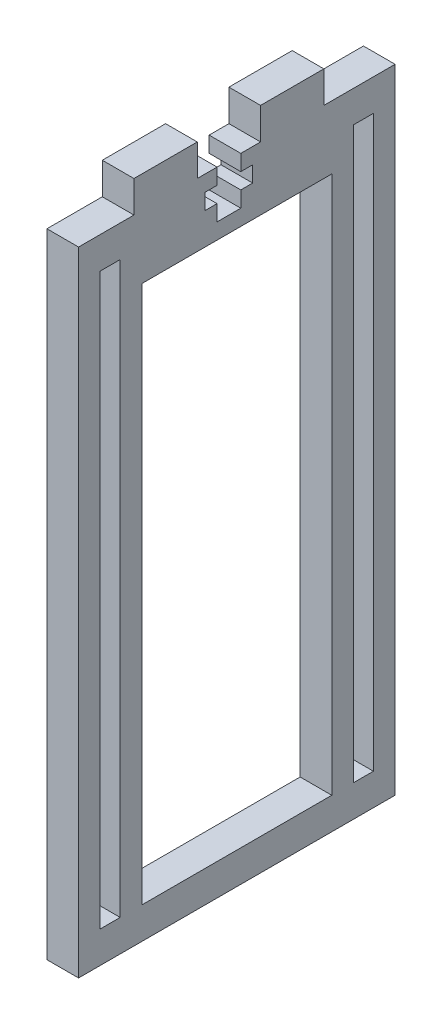
ISO-10303-21;
HEADER;
FILE_DESCRIPTION(('STEP AP214'),'2;1');
FILE_NAME('part.step','',(''),(''),'','','');
FILE_SCHEMA(('AUTOMOTIVE_DESIGN { 1 0 10303 214 1 1 1 1 }'));
ENDSEC;
DATA;
#1=APPLICATION_CONTEXT('core data for automotive mechanical design processes');
#2=APPLICATION_PROTOCOL_DEFINITION('international standard','automotive_design',2000,#1);
#3=PRODUCT_CONTEXT('',#1,'mechanical');
#4=PRODUCT('Part','Part','',(#3));
#5=PRODUCT_RELATED_PRODUCT_CATEGORY('part','',(#4));
#6=PRODUCT_DEFINITION_FORMATION('','',#4);
#7=PRODUCT_DEFINITION_CONTEXT('part definition',#1,'design');
#8=PRODUCT_DEFINITION('design','',#6,#7);
#9=PRODUCT_DEFINITION_SHAPE('','',#8);
#10=(LENGTH_UNIT() NAMED_UNIT(*) SI_UNIT(.MILLI.,.METRE.));
#11=(NAMED_UNIT(*) PLANE_ANGLE_UNIT() SI_UNIT($,.RADIAN.));
#12=(NAMED_UNIT(*) SI_UNIT($,.STERADIAN.) SOLID_ANGLE_UNIT());
#13=UNCERTAINTY_MEASURE_WITH_UNIT(LENGTH_MEASURE(1.E-05),#10,'distance_accuracy_value','');
#14=(GEOMETRIC_REPRESENTATION_CONTEXT(3) GLOBAL_UNCERTAINTY_ASSIGNED_CONTEXT((#13)) GLOBAL_UNIT_ASSIGNED_CONTEXT((#10,
#11,#12)) REPRESENTATION_CONTEXT('',''));
#15=CARTESIAN_POINT('',(0.,0.,0.));
#16=DIRECTION('',(0.,0.,1.));
#17=DIRECTION('',(1.,0.,0.));
#18=AXIS2_PLACEMENT_3D('',#15,#16,#17);
#19=CARTESIAN_POINT('',(6.35,127.,0.));
#20=DIRECTION('',(0.,1.,0.));
#21=DIRECTION('',(0.,0.,1.));
#22=AXIS2_PLACEMENT_3D('',#19,#20,#21);
#23=PLANE('',#22);
#24=DIRECTION('',(0.,0.,-1.));
#25=VECTOR('',#24,1.);
#26=CARTESIAN_POINT('',(6.35,127.,0.));
#27=LINE('',#26,#25);
#28=CARTESIAN_POINT('',(6.35,127.,-23.8125));
#29=VERTEX_POINT('',#28);
#30=CARTESIAN_POINT('',(6.35,127.,-27.78125));
#31=VERTEX_POINT('',#30);
#32=EDGE_CURVE('E435',#29,#31,#27,.T.);
#33=ORIENTED_EDGE('',*,*,#32,.T.);
#34=DIRECTION('',(-1.,0.,0.));
#35=VECTOR('',#34,1.);
#36=CARTESIAN_POINT('',(6.35,127.,-27.78125));
#37=LINE('',#36,#35);
#38=CARTESIAN_POINT('',(0.,127.,-27.78125));
#39=VERTEX_POINT('',#38);
#40=EDGE_CURVE('E341',#31,#39,#37,.T.);
#41=ORIENTED_EDGE('',*,*,#40,.T.);
#42=DIRECTION('',(0.,0.,-1.));
#43=VECTOR('',#42,1.);
#44=CARTESIAN_POINT('',(0.,127.,0.));
#45=LINE('',#44,#43);
#46=CARTESIAN_POINT('',(0.,127.,-23.8125));
#47=VERTEX_POINT('',#46);
#48=EDGE_CURVE('E499',#47,#39,#45,.T.);
#49=ORIENTED_EDGE('',*,*,#48,.F.);
#50=DIRECTION('',(-1.,0.,0.));
#51=VECTOR('',#50,1.);
#52=CARTESIAN_POINT('',(6.35,127.,-23.8125));
#53=LINE('',#52,#51);
#54=EDGE_CURVE('E534',#29,#47,#53,.T.);
#55=ORIENTED_EDGE('',*,*,#54,.F.);
#56=EDGE_LOOP('',(#33,#41,#49,#55));
#57=FACE_BOUND('',#56,.T.);
#58=ADVANCED_FACE('F59',(#57),#23,.T.);
#59=CARTESIAN_POINT('',(6.35,0.,-63.5));
#60=DIRECTION('',(0.,0.,1.));
#61=DIRECTION('',(1.,0.,0.));
#62=AXIS2_PLACEMENT_3D('',#59,#60,#61);
#63=PLANE('',#62);
#64=DIRECTION('',(0.,1.,0.));
#65=VECTOR('',#64,1.);
#66=CARTESIAN_POINT('',(0.,0.,-63.5));
#67=LINE('',#66,#65);
#68=CARTESIAN_POINT('',(0.,0.,-63.5));
#69=VERTEX_POINT('',#68);
#70=CARTESIAN_POINT('',(0.,127.,-63.5));
#71=VERTEX_POINT('',#70);
#72=EDGE_CURVE('E481',#69,#71,#67,.T.);
#73=ORIENTED_EDGE('',*,*,#72,.T.);
#74=DIRECTION('',(-1.,0.,0.));
#75=VECTOR('',#74,1.);
#76=CARTESIAN_POINT('',(6.35,127.,-63.5));
#77=LINE('',#76,#75);
#78=CARTESIAN_POINT('',(6.35,127.,-63.5));
#79=VERTEX_POINT('',#78);
#80=EDGE_CURVE('E68',#79,#71,#77,.T.);
#81=ORIENTED_EDGE('',*,*,#80,.F.);
#82=DIRECTION('',(0.,1.,0.));
#83=VECTOR('',#82,1.);
#84=CARTESIAN_POINT('',(6.35,0.,-63.5));
#85=LINE('',#84,#83);
#86=CARTESIAN_POINT('',(6.35,0.,-63.5));
#87=VERTEX_POINT('',#86);
#88=EDGE_CURVE('E421',#87,#79,#85,.T.);
#89=ORIENTED_EDGE('',*,*,#88,.F.);
#90=DIRECTION('',(-1.,0.,0.));
#91=VECTOR('',#90,1.);
#92=CARTESIAN_POINT('',(6.35,0.,-63.5));
#93=LINE('',#92,#91);
#94=EDGE_CURVE('E12',#87,#69,#93,.T.);
#95=ORIENTED_EDGE('',*,*,#94,.T.);
#96=EDGE_LOOP('',(#73,#81,#89,#95));
#97=FACE_BOUND('',#96,.T.);
#98=ADVANCED_FACE('F586',(#97),#63,.F.);
#99=CARTESIAN_POINT('',(6.35,127.,0.));
#100=DIRECTION('',(0.,1.,0.));
#101=DIRECTION('',(0.,0.,1.));
#102=AXIS2_PLACEMENT_3D('',#99,#100,#101);
#103=PLANE('',#102);
#104=DIRECTION('',(0.,0.,-1.));
#105=VECTOR('',#104,1.);
#106=CARTESIAN_POINT('',(0.,127.,0.));
#107=LINE('',#106,#105);
#108=CARTESIAN_POINT('',(0.,127.,-49.2125));
#109=VERTEX_POINT('',#108);
#110=EDGE_CURVE('E486',#109,#71,#107,.T.);
#111=ORIENTED_EDGE('',*,*,#110,.F.);
#112=DIRECTION('',(-1.,0.,0.));
#113=VECTOR('',#112,1.);
#114=CARTESIAN_POINT('',(6.35,127.,-49.2125));
#115=LINE('',#114,#113);
#116=CARTESIAN_POINT('',(6.35,127.,-49.2125));
#117=VERTEX_POINT('',#116);
#118=EDGE_CURVE('E543',#117,#109,#115,.T.);
#119=ORIENTED_EDGE('',*,*,#118,.F.);
#120=DIRECTION('',(0.,0.,-1.));
#121=VECTOR('',#120,1.);
#122=CARTESIAN_POINT('',(6.35,127.,0.));
#123=LINE('',#122,#121);
#124=EDGE_CURVE('E423',#117,#79,#123,.T.);
#125=ORIENTED_EDGE('',*,*,#124,.T.);
#126=ORIENTED_EDGE('',*,*,#80,.T.);
#127=EDGE_LOOP('',(#111,#119,#125,#126));
#128=FACE_BOUND('',#127,.T.);
#129=ADVANCED_FACE('F593',(#128),#103,.T.);
#130=CARTESIAN_POINT('',(6.35,0.,-49.2125));
#131=DIRECTION('',(0.,0.,1.));
#132=DIRECTION('',(1.,0.,0.));
#133=AXIS2_PLACEMENT_3D('',#130,#131,#132);
#134=PLANE('',#133);
#135=DIRECTION('',(0.,1.,0.));
#136=VECTOR('',#135,1.);
#137=CARTESIAN_POINT('',(0.,0.,-49.2125));
#138=LINE('',#137,#136);
#139=CARTESIAN_POINT('',(0.,133.35,-49.2125));
#140=VERTEX_POINT('',#139);
#141=EDGE_CURVE('E489',#109,#140,#138,.T.);
#142=ORIENTED_EDGE('',*,*,#141,.T.);
#143=DIRECTION('',(-1.,0.,0.));
#144=VECTOR('',#143,1.);
#145=CARTESIAN_POINT('',(6.35,133.35,-49.2125));
#146=LINE('',#145,#144);
#147=CARTESIAN_POINT('',(6.35,133.35,-49.2125));
#148=VERTEX_POINT('',#147);
#149=EDGE_CURVE('E541',#148,#140,#146,.T.);
#150=ORIENTED_EDGE('',*,*,#149,.F.);
#151=DIRECTION('',(0.,1.,0.));
#152=VECTOR('',#151,1.);
#153=CARTESIAN_POINT('',(6.35,0.,-49.2125));
#154=LINE('',#153,#152);
#155=EDGE_CURVE('E426',#117,#148,#154,.T.);
#156=ORIENTED_EDGE('',*,*,#155,.F.);
#157=ORIENTED_EDGE('',*,*,#118,.T.);
#158=EDGE_LOOP('',(#142,#150,#156,#157));
#159=FACE_BOUND('',#158,.T.);
#160=ADVANCED_FACE('F704',(#159),#134,.F.);
#161=CARTESIAN_POINT('',(6.35,133.35,0.));
#162=DIRECTION('',(0.,1.,0.));
#163=DIRECTION('',(0.,0.,1.));
#164=AXIS2_PLACEMENT_3D('',#161,#162,#163);
#165=PLANE('',#164);
#166=DIRECTION('',(0.,0.,-1.));
#167=VECTOR('',#166,1.);
#168=CARTESIAN_POINT('',(0.,133.35,0.));
#169=LINE('',#168,#167);
#170=CARTESIAN_POINT('',(0.,133.35,-36.5125));
#171=VERTEX_POINT('',#170);
#172=EDGE_CURVE('E492',#171,#140,#169,.T.);
#173=ORIENTED_EDGE('',*,*,#172,.F.);
#174=DIRECTION('',(-1.,0.,0.));
#175=VECTOR('',#174,1.);
#176=CARTESIAN_POINT('',(6.35,133.35,-36.5125));
#177=LINE('',#176,#175);
#178=CARTESIAN_POINT('',(6.35,133.35,-36.5125));
#179=VERTEX_POINT('',#178);
#180=EDGE_CURVE('E539',#179,#171,#177,.T.);
#181=ORIENTED_EDGE('',*,*,#180,.F.);
#182=DIRECTION('',(0.,0.,-1.));
#183=VECTOR('',#182,1.);
#184=CARTESIAN_POINT('',(6.35,133.35,0.));
#185=LINE('',#184,#183);
#186=EDGE_CURVE('E428',#179,#148,#185,.T.);
#187=ORIENTED_EDGE('',*,*,#186,.T.);
#188=ORIENTED_EDGE('',*,*,#149,.T.);
#189=EDGE_LOOP('',(#173,#181,#187,#188));
#190=FACE_BOUND('',#189,.T.);
#191=ADVANCED_FACE('F608',(#190),#165,.T.);
#192=CARTESIAN_POINT('',(6.35,0.,-36.5125));
#193=DIRECTION('',(0.,0.,1.));
#194=DIRECTION('',(1.,0.,0.));
#195=AXIS2_PLACEMENT_3D('',#192,#193,#194);
#196=PLANE('',#195);
#197=DIRECTION('',(0.,1.,0.));
#198=VECTOR('',#197,1.);
#199=CARTESIAN_POINT('',(0.,0.,-36.5125));
#200=LINE('',#199,#198);
#201=CARTESIAN_POINT('',(0.,127.,-36.5125));
#202=VERTEX_POINT('',#201);
#203=EDGE_CURVE('E495',#202,#171,#200,.T.);
#204=ORIENTED_EDGE('',*,*,#203,.F.);
#205=DIRECTION('',(-1.,0.,0.));
#206=VECTOR('',#205,1.);
#207=CARTESIAN_POINT('',(6.35,127.,-36.5125));
#208=LINE('',#207,#206);
#209=CARTESIAN_POINT('',(6.35,127.,-36.5125));
#210=VERTEX_POINT('',#209);
#211=EDGE_CURVE('E536',#210,#202,#208,.T.);
#212=ORIENTED_EDGE('',*,*,#211,.F.);
#213=DIRECTION('',(0.,1.,0.));
#214=VECTOR('',#213,1.);
#215=CARTESIAN_POINT('',(6.35,0.,-36.5125));
#216=LINE('',#215,#214);
#217=EDGE_CURVE('E431',#210,#179,#216,.T.);
#218=ORIENTED_EDGE('',*,*,#217,.T.);
#219=ORIENTED_EDGE('',*,*,#180,.T.);
#220=EDGE_LOOP('',(#204,#212,#218,#219));
#221=FACE_BOUND('',#220,.T.);
#222=ADVANCED_FACE('F600',(#221),#196,.T.);
#223=DIRECTION('',(-1.,0.,0.));
#224=VECTOR('',#223,1.);
#225=CARTESIAN_POINT('',(6.35,127.,-32.54375));
#226=LINE('',#225,#224);
#227=CARTESIAN_POINT('',(6.35,127.,-32.54375));
#228=VERTEX_POINT('',#227);
#229=CARTESIAN_POINT('',(0.,127.,-32.54375));
#230=VERTEX_POINT('',#229);
#231=EDGE_CURVE('E329',#228,#230,#226,.T.);
#232=ORIENTED_EDGE('',*,*,#231,.F.);
#233=EDGE_CURVE('E434',#228,#210,#27,.T.);
#234=ORIENTED_EDGE('',*,*,#233,.T.);
#235=ORIENTED_EDGE('',*,*,#211,.T.);
#236=EDGE_CURVE('E498',#230,#202,#45,.T.);
#237=ORIENTED_EDGE('',*,*,#236,.F.);
#238=EDGE_LOOP('',(#232,#234,#235,#237));
#239=FACE_BOUND('',#238,.T.);
#240=ADVANCED_FACE('F589',(#239),#23,.T.);
#241=CARTESIAN_POINT('',(6.35,0.,-23.8125));
#242=DIRECTION('',(0.,0.,1.));
#243=DIRECTION('',(1.,0.,0.));
#244=AXIS2_PLACEMENT_3D('',#241,#242,#243);
#245=PLANE('',#244);
#246=DIRECTION('',(0.,1.,0.));
#247=VECTOR('',#246,1.);
#248=CARTESIAN_POINT('',(0.,0.,-23.8125));
#249=LINE('',#248,#247);
#250=CARTESIAN_POINT('',(0.,133.35,-23.8125));
#251=VERTEX_POINT('',#250);
#252=EDGE_CURVE('E502',#47,#251,#249,.T.);
#253=ORIENTED_EDGE('',*,*,#252,.T.);
#254=DIRECTION('',(-1.,0.,0.));
#255=VECTOR('',#254,1.);
#256=CARTESIAN_POINT('',(6.35,133.35,-23.8125));
#257=LINE('',#256,#255);
#258=CARTESIAN_POINT('',(6.35,133.35,-23.8125));
#259=VERTEX_POINT('',#258);
#260=EDGE_CURVE('E532',#259,#251,#257,.T.);
#261=ORIENTED_EDGE('',*,*,#260,.F.);
#262=DIRECTION('',(0.,1.,0.));
#263=VECTOR('',#262,1.);
#264=CARTESIAN_POINT('',(6.35,0.,-23.8125));
#265=LINE('',#264,#263);
#266=EDGE_CURVE('E438',#29,#259,#265,.T.);
#267=ORIENTED_EDGE('',*,*,#266,.F.);
#268=ORIENTED_EDGE('',*,*,#54,.T.);
#269=EDGE_LOOP('',(#253,#261,#267,#268));
#270=FACE_BOUND('',#269,.T.);
#271=ADVANCED_FACE('F599',(#270),#245,.F.);
#272=CARTESIAN_POINT('',(6.35,133.35,0.));
#273=DIRECTION('',(0.,1.,0.));
#274=DIRECTION('',(0.,0.,1.));
#275=AXIS2_PLACEMENT_3D('',#272,#273,#274);
#276=PLANE('',#275);
#277=DIRECTION('',(0.,0.,-1.));
#278=VECTOR('',#277,1.);
#279=CARTESIAN_POINT('',(0.,133.35,0.));
#280=LINE('',#279,#278);
#281=CARTESIAN_POINT('',(0.,133.35,-11.1125));
#282=VERTEX_POINT('',#281);
#283=EDGE_CURVE('E505',#282,#251,#280,.T.);
#284=ORIENTED_EDGE('',*,*,#283,.F.);
#285=DIRECTION('',(-1.,0.,0.));
#286=VECTOR('',#285,1.);
#287=CARTESIAN_POINT('',(6.35,133.35,-11.1125));
#288=LINE('',#287,#286);
#289=CARTESIAN_POINT('',(6.35,133.35,-11.1125));
#290=VERTEX_POINT('',#289);
#291=EDGE_CURVE('E530',#290,#282,#288,.T.);
#292=ORIENTED_EDGE('',*,*,#291,.F.);
#293=DIRECTION('',(0.,0.,-1.));
#294=VECTOR('',#293,1.);
#295=CARTESIAN_POINT('',(6.35,133.35,0.));
#296=LINE('',#295,#294);
#297=EDGE_CURVE('E440',#290,#259,#296,.T.);
#298=ORIENTED_EDGE('',*,*,#297,.T.);
#299=ORIENTED_EDGE('',*,*,#260,.T.);
#300=EDGE_LOOP('',(#284,#292,#298,#299));
#301=FACE_BOUND('',#300,.T.);
#302=ADVANCED_FACE('F606',(#301),#276,.T.);
#303=CARTESIAN_POINT('',(6.35,0.,-11.1125));
#304=DIRECTION('',(0.,0.,1.));
#305=DIRECTION('',(1.,0.,0.));
#306=AXIS2_PLACEMENT_3D('',#303,#304,#305);
#307=PLANE('',#306);
#308=DIRECTION('',(0.,1.,0.));
#309=VECTOR('',#308,1.);
#310=CARTESIAN_POINT('',(0.,0.,-11.1125));
#311=LINE('',#310,#309);
#312=CARTESIAN_POINT('',(0.,127.,-11.1125));
#313=VERTEX_POINT('',#312);
#314=EDGE_CURVE('E508',#313,#282,#311,.T.);
#315=ORIENTED_EDGE('',*,*,#314,.F.);
#316=DIRECTION('',(-1.,0.,0.));
#317=VECTOR('',#316,1.);
#318=CARTESIAN_POINT('',(6.35,127.,-11.1125));
#319=LINE('',#318,#317);
#320=CARTESIAN_POINT('',(6.35,127.,-11.1125));
#321=VERTEX_POINT('',#320);
#322=EDGE_CURVE('E528',#321,#313,#319,.T.);
#323=ORIENTED_EDGE('',*,*,#322,.F.);
#324=DIRECTION('',(0.,1.,0.));
#325=VECTOR('',#324,1.);
#326=CARTESIAN_POINT('',(6.35,0.,-11.1125));
#327=LINE('',#326,#325);
#328=EDGE_CURVE('E443',#321,#290,#327,.T.);
#329=ORIENTED_EDGE('',*,*,#328,.T.);
#330=ORIENTED_EDGE('',*,*,#291,.T.);
#331=EDGE_LOOP('',(#315,#323,#329,#330));
#332=FACE_BOUND('',#331,.T.);
#333=ADVANCED_FACE('F682',(#332),#307,.T.);
#334=CARTESIAN_POINT('',(6.35,127.,0.));
#335=DIRECTION('',(0.,1.,0.));
#336=DIRECTION('',(0.,0.,1.));
#337=AXIS2_PLACEMENT_3D('',#334,#335,#336);
#338=PLANE('',#337);
#339=DIRECTION('',(0.,0.,-1.));
#340=VECTOR('',#339,1.);
#341=CARTESIAN_POINT('',(0.,127.,0.));
#342=LINE('',#341,#340);
#343=CARTESIAN_POINT('',(0.,127.,0.));
#344=VERTEX_POINT('',#343);
#345=EDGE_CURVE('E511',#344,#313,#342,.T.);
#346=ORIENTED_EDGE('',*,*,#345,.F.);
#347=DIRECTION('',(-1.,0.,0.));
#348=VECTOR('',#347,1.);
#349=CARTESIAN_POINT('',(6.35,127.,0.));
#350=LINE('',#349,#348);
#351=CARTESIAN_POINT('',(6.35,127.,0.));
#352=VERTEX_POINT('',#351);
#353=EDGE_CURVE('E526',#352,#344,#350,.T.);
#354=ORIENTED_EDGE('',*,*,#353,.F.);
#355=DIRECTION('',(0.,0.,-1.));
#356=VECTOR('',#355,1.);
#357=CARTESIAN_POINT('',(6.35,127.,0.));
#358=LINE('',#357,#356);
#359=EDGE_CURVE('E446',#352,#321,#358,.T.);
#360=ORIENTED_EDGE('',*,*,#359,.T.);
#361=ORIENTED_EDGE('',*,*,#322,.T.);
#362=EDGE_LOOP('',(#346,#354,#360,#361));
#363=FACE_BOUND('',#362,.T.);
#364=ADVANCED_FACE('F686',(#363),#338,.T.);
#365=CARTESIAN_POINT('',(6.35,0.,0.));
#366=DIRECTION('',(0.,0.,-1.));
#367=DIRECTION('',(-1.,0.,0.));
#368=AXIS2_PLACEMENT_3D('',#365,#366,#367);
#369=PLANE('',#368);
#370=DIRECTION('',(0.,-1.,0.));
#371=VECTOR('',#370,1.);
#372=CARTESIAN_POINT('',(0.,0.,0.));
#373=LINE('',#372,#371);
#374=CARTESIAN_POINT('',(0.,0.,0.));
#375=VERTEX_POINT('',#374);
#376=EDGE_CURVE('E483',#344,#375,#373,.T.);
#377=ORIENTED_EDGE('',*,*,#376,.T.);
#378=DIRECTION('',(-1.,0.,0.));
#379=VECTOR('',#378,1.);
#380=CARTESIAN_POINT('',(6.35,0.,0.));
#381=LINE('',#380,#379);
#382=CARTESIAN_POINT('',(6.35,0.,0.));
#383=VERTEX_POINT('',#382);
#384=EDGE_CURVE('E523',#383,#375,#381,.T.);
#385=ORIENTED_EDGE('',*,*,#384,.F.);
#386=DIRECTION('',(0.,-1.,0.));
#387=VECTOR('',#386,1.);
#388=CARTESIAN_POINT('',(6.35,0.,0.));
#389=LINE('',#388,#387);
#390=EDGE_CURVE('E449',#352,#383,#389,.T.);
#391=ORIENTED_EDGE('',*,*,#390,.F.);
#392=ORIENTED_EDGE('',*,*,#353,.T.);
#393=EDGE_LOOP('',(#377,#385,#391,#392));
#394=FACE_BOUND('',#393,.T.);
#395=ADVANCED_FACE('F691',(#394),#369,.F.);
#396=CARTESIAN_POINT('',(6.35,0.,0.));
#397=DIRECTION('',(0.,1.,0.));
#398=DIRECTION('',(0.,0.,1.));
#399=AXIS2_PLACEMENT_3D('',#396,#397,#398);
#400=PLANE('',#399);
#401=DIRECTION('',(0.,0.,-1.));
#402=VECTOR('',#401,1.);
#403=CARTESIAN_POINT('',(0.,0.,0.));
#404=LINE('',#403,#402);
#405=EDGE_CURVE('E304',#375,#69,#404,.T.);
#406=ORIENTED_EDGE('',*,*,#405,.T.);
#407=ORIENTED_EDGE('',*,*,#94,.F.);
#408=DIRECTION('',(0.,0.,-1.));
#409=VECTOR('',#408,1.);
#410=CARTESIAN_POINT('',(6.35,0.,0.));
#411=LINE('',#410,#409);
#412=EDGE_CURVE('E418',#383,#87,#411,.T.);
#413=ORIENTED_EDGE('',*,*,#412,.F.);
#414=ORIENTED_EDGE('',*,*,#384,.T.);
#415=EDGE_LOOP('',(#406,#407,#413,#414));
#416=FACE_BOUND('',#415,.T.);
#417=ADVANCED_FACE('F696',(#416),#400,.F.);
#418=CARTESIAN_POINT('',(6.35,0.,-12.7));
#419=DIRECTION('',(0.,0.,1.));
#420=DIRECTION('',(1.,0.,0.));
#421=AXIS2_PLACEMENT_3D('',#418,#419,#420);
#422=PLANE('',#421);
#423=DIRECTION('',(0.,1.,0.));
#424=VECTOR('',#423,1.);
#425=CARTESIAN_POINT('',(6.35,0.,-12.7));
#426=LINE('',#425,#424);
#427=CARTESIAN_POINT('',(6.35,6.34999999999999,-12.7));
#428=VERTEX_POINT('',#427);
#429=CARTESIAN_POINT('',(6.35,114.3,-12.7));
#430=VERTEX_POINT('',#429);
#431=EDGE_CURVE('E84',#428,#430,#426,.T.);
#432=ORIENTED_EDGE('',*,*,#431,.F.);
#433=DIRECTION('',(1.,0.,0.));
#434=VECTOR('',#433,1.);
#435=CARTESIAN_POINT('',(0.,6.34999999999999,-12.7));
#436=LINE('',#435,#434);
#437=CARTESIAN_POINT('',(0.,6.34999999999999,-12.7));
#438=VERTEX_POINT('',#437);
#439=EDGE_CURVE('E306',#438,#428,#436,.T.);
#440=ORIENTED_EDGE('',*,*,#439,.F.);
#441=DIRECTION('',(0.,1.,0.));
#442=VECTOR('',#441,1.);
#443=CARTESIAN_POINT('',(0.,0.,-12.7));
#444=LINE('',#443,#442);
#445=CARTESIAN_POINT('',(0.,114.3,-12.7));
#446=VERTEX_POINT('',#445);
#447=EDGE_CURVE('E296',#438,#446,#444,.T.);
#448=ORIENTED_EDGE('',*,*,#447,.T.);
#449=DIRECTION('',(-1.,0.,0.));
#450=VECTOR('',#449,1.);
#451=CARTESIAN_POINT('',(6.35,114.3,-12.7));
#452=LINE('',#451,#450);
#453=EDGE_CURVE('E520',#430,#446,#452,.T.);
#454=ORIENTED_EDGE('',*,*,#453,.F.);
#455=EDGE_LOOP('',(#432,#440,#448,#454));
#456=FACE_BOUND('',#455,.T.);
#457=ADVANCED_FACE('F307',(#456),#422,.F.);
#458=CARTESIAN_POINT('',(6.35,114.3,0.));
#459=DIRECTION('',(0.,1.,0.));
#460=DIRECTION('',(0.,0.,1.));
#461=AXIS2_PLACEMENT_3D('',#458,#459,#460);
#462=PLANE('',#461);
#463=DIRECTION('',(0.,0.,-1.));
#464=VECTOR('',#463,1.);
#465=CARTESIAN_POINT('',(0.,114.3,0.));
#466=LINE('',#465,#464);
#467=CARTESIAN_POINT('',(0.,114.3,-50.8));
#468=VERTEX_POINT('',#467);
#469=EDGE_CURVE('E302',#446,#468,#466,.T.);
#470=ORIENTED_EDGE('',*,*,#469,.T.);
#471=DIRECTION('',(-1.,0.,0.));
#472=VECTOR('',#471,1.);
#473=CARTESIAN_POINT('',(6.35,114.3,-50.8));
#474=LINE('',#473,#472);
#475=CARTESIAN_POINT('',(6.35,114.3,-50.8));
#476=VERTEX_POINT('',#475);
#477=EDGE_CURVE('E517',#476,#468,#474,.T.);
#478=ORIENTED_EDGE('',*,*,#477,.F.);
#479=DIRECTION('',(0.,0.,-1.));
#480=VECTOR('',#479,1.);
#481=CARTESIAN_POINT('',(6.35,114.3,0.));
#482=LINE('',#481,#480);
#483=EDGE_CURVE('E453',#430,#476,#482,.T.);
#484=ORIENTED_EDGE('',*,*,#483,.F.);
#485=ORIENTED_EDGE('',*,*,#453,.T.);
#486=EDGE_LOOP('',(#470,#478,#484,#485));
#487=FACE_BOUND('',#486,.T.);
#488=ADVANCED_FACE('F725',(#487),#462,.F.);
#489=CARTESIAN_POINT('',(6.35,120.65,0.));
#490=DIRECTION('',(0.,1.,0.));
#491=DIRECTION('',(0.,0.,1.));
#492=AXIS2_PLACEMENT_3D('',#489,#490,#491);
#493=PLANE('',#492);
#494=DIRECTION('',(0.,0.,-1.));
#495=VECTOR('',#494,1.);
#496=CARTESIAN_POINT('',(0.,120.65,0.));
#497=LINE('',#496,#495);
#498=CARTESIAN_POINT('',(0.,120.65,-4.35));
#499=VERTEX_POINT('',#498);
#500=CARTESIAN_POINT('',(0.,120.65,-8.35));
#501=VERTEX_POINT('',#500);
#502=EDGE_CURVE('E469',#499,#501,#497,.T.);
#503=ORIENTED_EDGE('',*,*,#502,.T.);
#504=DIRECTION('',(-1.,0.,0.));
#505=VECTOR('',#504,1.);
#506=CARTESIAN_POINT('',(6.35,120.65,-8.35));
#507=LINE('',#506,#505);
#508=CARTESIAN_POINT('',(6.35,120.65,-8.35));
#509=VERTEX_POINT('',#508);
#510=EDGE_CURVE('E521',#509,#501,#507,.T.);
#511=ORIENTED_EDGE('',*,*,#510,.F.);
#512=DIRECTION('',(0.,0.,-1.));
#513=VECTOR('',#512,1.);
#514=CARTESIAN_POINT('',(6.35,120.65,0.));
#515=LINE('',#514,#513);
#516=CARTESIAN_POINT('',(6.35,120.65,-4.35));
#517=VERTEX_POINT('',#516);
#518=EDGE_CURVE('E407',#517,#509,#515,.T.);
#519=ORIENTED_EDGE('',*,*,#518,.F.);
#520=DIRECTION('',(-1.,0.,0.));
#521=VECTOR('',#520,1.);
#522=CARTESIAN_POINT('',(6.35,120.65,-4.35));
#523=LINE('',#522,#521);
#524=EDGE_CURVE('E546',#517,#499,#523,.T.);
#525=ORIENTED_EDGE('',*,*,#524,.T.);
#526=EDGE_LOOP('',(#503,#511,#519,#525));
#527=FACE_BOUND('',#526,.T.);
#528=ADVANCED_FACE('F722',(#527),#493,.F.);
#529=CARTESIAN_POINT('',(6.35,0.,-8.35000000000001));
#530=DIRECTION('',(0.,0.,-1.));
#531=DIRECTION('',(0.,1.,0.));
#532=AXIS2_PLACEMENT_3D('',#529,#530,#531);
#533=PLANE('',#532);
#534=DIRECTION('',(0.,-1.,0.));
#535=VECTOR('',#534,1.);
#536=CARTESIAN_POINT('',(0.,0.,-8.35000000000001));
#537=LINE('',#536,#535);
#538=CARTESIAN_POINT('',(0.,6.35,-8.35000000000001));
#539=VERTEX_POINT('',#538);
#540=EDGE_CURVE('E472',#501,#539,#537,.T.);
#541=ORIENTED_EDGE('',*,*,#540,.T.);
#542=DIRECTION('',(-1.,0.,0.));
#543=VECTOR('',#542,1.);
#544=CARTESIAN_POINT('',(6.35,6.35,-8.35000000000001));
#545=LINE('',#544,#543);
#546=CARTESIAN_POINT('',(6.35,6.35,-8.35000000000001));
#547=VERTEX_POINT('',#546);
#548=EDGE_CURVE('E550',#547,#539,#545,.T.);
#549=ORIENTED_EDGE('',*,*,#548,.F.);
#550=DIRECTION('',(0.,-1.,0.));
#551=VECTOR('',#550,1.);
#552=CARTESIAN_POINT('',(6.35,0.,-8.35000000000001));
#553=LINE('',#552,#551);
#554=EDGE_CURVE('E410',#509,#547,#553,.T.);
#555=ORIENTED_EDGE('',*,*,#554,.F.);
#556=ORIENTED_EDGE('',*,*,#510,.T.);
#557=EDGE_LOOP('',(#541,#549,#555,#556));
#558=FACE_BOUND('',#557,.T.);
#559=ADVANCED_FACE('F718',(#558),#533,.F.);
#560=CARTESIAN_POINT('',(6.35,6.34999999999999,0.));
#561=DIRECTION('',(0.,1.,0.));
#562=DIRECTION('',(0.,0.,1.));
#563=AXIS2_PLACEMENT_3D('',#560,#561,#562);
#564=PLANE('',#563);
#565=DIRECTION('',(0.,0.,-1.));
#566=VECTOR('',#565,1.);
#567=CARTESIAN_POINT('',(0.,6.34999999999999,0.));
#568=LINE('',#567,#566);
#569=CARTESIAN_POINT('',(0.,6.34999999999999,-4.35000000000001));
#570=VERTEX_POINT('',#569);
#571=EDGE_CURVE('E475',#570,#539,#568,.T.);
#572=ORIENTED_EDGE('',*,*,#571,.F.);
#573=DIRECTION('',(-1.,0.,0.));
#574=VECTOR('',#573,1.);
#575=CARTESIAN_POINT('',(6.35,6.34999999999999,-4.35000000000001));
#576=LINE('',#575,#574);
#577=CARTESIAN_POINT('',(6.35,6.34999999999999,-4.35000000000001));
#578=VERTEX_POINT('',#577);
#579=EDGE_CURVE('E548',#578,#570,#576,.T.);
#580=ORIENTED_EDGE('',*,*,#579,.F.);
#581=DIRECTION('',(0.,0.,-1.));
#582=VECTOR('',#581,1.);
#583=CARTESIAN_POINT('',(6.35,6.34999999999999,0.));
#584=LINE('',#583,#582);
#585=EDGE_CURVE('E412',#578,#547,#584,.T.);
#586=ORIENTED_EDGE('',*,*,#585,.T.);
#587=ORIENTED_EDGE('',*,*,#548,.T.);
#588=EDGE_LOOP('',(#572,#580,#586,#587));
#589=FACE_BOUND('',#588,.T.);
#590=ADVANCED_FACE('F715',(#589),#564,.T.);
#591=CARTESIAN_POINT('',(6.35,120.65,0.));
#592=DIRECTION('',(0.,1.,0.));
#593=DIRECTION('',(0.,0.,1.));
#594=AXIS2_PLACEMENT_3D('',#591,#592,#593);
#595=PLANE('',#594);
#596=DIRECTION('',(0.,0.,-1.));
#597=VECTOR('',#596,1.);
#598=CARTESIAN_POINT('',(0.,120.65,0.));
#599=LINE('',#598,#597);
#600=CARTESIAN_POINT('',(0.,120.65,-55.15));
#601=VERTEX_POINT('',#600);
#602=CARTESIAN_POINT('',(0.,120.65,-59.15));
#603=VERTEX_POINT('',#602);
#604=EDGE_CURVE('E394',#601,#603,#599,.T.);
#605=ORIENTED_EDGE('',*,*,#604,.T.);
#606=DIRECTION('',(-1.,0.,0.));
#607=VECTOR('',#606,1.);
#608=CARTESIAN_POINT('',(6.35,120.65,-59.15));
#609=LINE('',#608,#607);
#610=CARTESIAN_POINT('',(6.35,120.65,-59.15));
#611=VERTEX_POINT('',#610);
#612=EDGE_CURVE('E63',#611,#603,#609,.T.);
#613=ORIENTED_EDGE('',*,*,#612,.F.);
#614=DIRECTION('',(0.,0.,-1.));
#615=VECTOR('',#614,1.);
#616=CARTESIAN_POINT('',(6.35,120.65,0.));
#617=LINE('',#616,#615);
#618=CARTESIAN_POINT('',(6.35,120.65,-55.15));
#619=VERTEX_POINT('',#618);
#620=EDGE_CURVE('E395',#619,#611,#617,.T.);
#621=ORIENTED_EDGE('',*,*,#620,.F.);
#622=DIRECTION('',(-1.,0.,0.));
#623=VECTOR('',#622,1.);
#624=CARTESIAN_POINT('',(6.35,120.65,-55.15));
#625=LINE('',#624,#623);
#626=EDGE_CURVE('E457',#619,#601,#625,.T.);
#627=ORIENTED_EDGE('',*,*,#626,.T.);
#628=EDGE_LOOP('',(#605,#613,#621,#627));
#629=FACE_BOUND('',#628,.T.);
#630=ADVANCED_FACE('F61',(#629),#595,.F.);
#631=CARTESIAN_POINT('',(6.35,0.,-59.15));
#632=DIRECTION('',(0.,0.,-1.));
#633=DIRECTION('',(0.,1.,0.));
#634=AXIS2_PLACEMENT_3D('',#631,#632,#633);
#635=PLANE('',#634);
#636=DIRECTION('',(0.,-1.,0.));
#637=VECTOR('',#636,1.);
#638=CARTESIAN_POINT('',(0.,0.,-59.15));
#639=LINE('',#638,#637);
#640=CARTESIAN_POINT('',(0.,6.35,-59.15));
#641=VERTEX_POINT('',#640);
#642=EDGE_CURVE('E460',#603,#641,#639,.T.);
#643=ORIENTED_EDGE('',*,*,#642,.T.);
#644=DIRECTION('',(-1.,0.,0.));
#645=VECTOR('',#644,1.);
#646=CARTESIAN_POINT('',(6.35,6.35,-59.15));
#647=LINE('',#646,#645);
#648=CARTESIAN_POINT('',(6.35,6.35,-59.15));
#649=VERTEX_POINT('',#648);
#650=EDGE_CURVE('E556',#649,#641,#647,.T.);
#651=ORIENTED_EDGE('',*,*,#650,.F.);
#652=DIRECTION('',(0.,-1.,0.));
#653=VECTOR('',#652,1.);
#654=CARTESIAN_POINT('',(6.35,0.,-59.15));
#655=LINE('',#654,#653);
#656=EDGE_CURVE('E398',#611,#649,#655,.T.);
#657=ORIENTED_EDGE('',*,*,#656,.F.);
#658=ORIENTED_EDGE('',*,*,#612,.T.);
#659=EDGE_LOOP('',(#643,#651,#657,#658));
#660=FACE_BOUND('',#659,.T.);
#661=ADVANCED_FACE('F563',(#660),#635,.F.);
#662=CARTESIAN_POINT('',(6.35,6.34999999999998,0.));
#663=DIRECTION('',(0.,1.,0.));
#664=DIRECTION('',(0.,0.,1.));
#665=AXIS2_PLACEMENT_3D('',#662,#663,#664);
#666=PLANE('',#665);
#667=DIRECTION('',(0.,0.,-1.));
#668=VECTOR('',#667,1.);
#669=CARTESIAN_POINT('',(0.,6.34999999999998,0.));
#670=LINE('',#669,#668);
#671=CARTESIAN_POINT('',(0.,6.34999999999999,-55.15));
#672=VERTEX_POINT('',#671);
#673=EDGE_CURVE('E463',#672,#641,#670,.T.);
#674=ORIENTED_EDGE('',*,*,#673,.F.);
#675=DIRECTION('',(-1.,0.,0.));
#676=VECTOR('',#675,1.);
#677=CARTESIAN_POINT('',(6.35,6.34999999999999,-55.15));
#678=LINE('',#677,#676);
#679=CARTESIAN_POINT('',(6.35,6.34999999999999,-55.15));
#680=VERTEX_POINT('',#679);
#681=EDGE_CURVE('E555',#680,#672,#678,.T.);
#682=ORIENTED_EDGE('',*,*,#681,.F.);
#683=DIRECTION('',(0.,0.,-1.));
#684=VECTOR('',#683,1.);
#685=CARTESIAN_POINT('',(6.35,6.34999999999998,0.));
#686=LINE('',#685,#684);
#687=EDGE_CURVE('E401',#680,#649,#686,.T.);
#688=ORIENTED_EDGE('',*,*,#687,.T.);
#689=ORIENTED_EDGE('',*,*,#650,.T.);
#690=EDGE_LOOP('',(#674,#682,#688,#689));
#691=FACE_BOUND('',#690,.T.);
#692=ADVANCED_FACE('F574',(#691),#666,.T.);
#693=CARTESIAN_POINT('',(6.35,0.,-4.35000000000001));
#694=DIRECTION('',(0.,0.,-1.));
#695=DIRECTION('',(0.,1.,0.));
#696=AXIS2_PLACEMENT_3D('',#693,#694,#695);
#697=PLANE('',#696);
#698=DIRECTION('',(0.,-1.,0.));
#699=VECTOR('',#698,1.);
#700=CARTESIAN_POINT('',(0.,0.,-4.35000000000001));
#701=LINE('',#700,#699);
#702=EDGE_CURVE('E478',#499,#570,#701,.T.);
#703=ORIENTED_EDGE('',*,*,#702,.F.);
#704=ORIENTED_EDGE('',*,*,#524,.F.);
#705=DIRECTION('',(0.,-1.,0.));
#706=VECTOR('',#705,1.);
#707=CARTESIAN_POINT('',(6.35,0.,-4.35000000000001));
#708=LINE('',#707,#706);
#709=EDGE_CURVE('E415',#517,#578,#708,.T.);
#710=ORIENTED_EDGE('',*,*,#709,.T.);
#711=ORIENTED_EDGE('',*,*,#579,.T.);
#712=EDGE_LOOP('',(#703,#704,#710,#711));
#713=FACE_BOUND('',#712,.T.);
#714=ADVANCED_FACE('F576',(#713),#697,.T.);
#715=CARTESIAN_POINT('',(6.35,0.,-55.15));
#716=DIRECTION('',(0.,0.,-1.));
#717=DIRECTION('',(0.,1.,0.));
#718=AXIS2_PLACEMENT_3D('',#715,#716,#717);
#719=PLANE('',#718);
#720=DIRECTION('',(0.,-1.,0.));
#721=VECTOR('',#720,1.);
#722=CARTESIAN_POINT('',(0.,0.,-55.15));
#723=LINE('',#722,#721);
#724=EDGE_CURVE('E466',#601,#672,#723,.T.);
#725=ORIENTED_EDGE('',*,*,#724,.F.);
#726=ORIENTED_EDGE('',*,*,#626,.F.);
#727=DIRECTION('',(0.,-1.,0.));
#728=VECTOR('',#727,1.);
#729=CARTESIAN_POINT('',(6.35,0.,-55.15));
#730=LINE('',#729,#728);
#731=EDGE_CURVE('E404',#619,#680,#730,.T.);
#732=ORIENTED_EDGE('',*,*,#731,.T.);
#733=ORIENTED_EDGE('',*,*,#681,.T.);
#734=EDGE_LOOP('',(#725,#726,#732,#733));
#735=FACE_BOUND('',#734,.T.);
#736=ADVANCED_FACE('F571',(#735),#719,.T.);
#737=CARTESIAN_POINT('',(6.35,0.,-50.8));
#738=DIRECTION('',(0.,0.,-1.));
#739=DIRECTION('',(-1.,0.,0.));
#740=AXIS2_PLACEMENT_3D('',#737,#738,#739);
#741=PLANE('',#740);
#742=DIRECTION('',(0.,-1.,0.));
#743=VECTOR('',#742,1.);
#744=CARTESIAN_POINT('',(0.,0.,-50.8));
#745=LINE('',#744,#743);
#746=CARTESIAN_POINT('',(0.,6.34999999999999,-50.8));
#747=VERTEX_POINT('',#746);
#748=EDGE_CURVE('E399',#468,#747,#745,.T.);
#749=ORIENTED_EDGE('',*,*,#748,.T.);
#750=DIRECTION('',(1.,0.,0.));
#751=VECTOR('',#750,1.);
#752=CARTESIAN_POINT('',(0.,6.34999999999999,-50.8));
#753=LINE('',#752,#751);
#754=CARTESIAN_POINT('',(6.35,6.34999999999999,-50.8));
#755=VERTEX_POINT('',#754);
#756=EDGE_CURVE('E76',#747,#755,#753,.T.);
#757=ORIENTED_EDGE('',*,*,#756,.T.);
#758=DIRECTION('',(0.,-1.,0.));
#759=VECTOR('',#758,1.);
#760=CARTESIAN_POINT('',(6.35,0.,-50.8));
#761=LINE('',#760,#759);
#762=EDGE_CURVE('E455',#476,#755,#761,.T.);
#763=ORIENTED_EDGE('',*,*,#762,.F.);
#764=ORIENTED_EDGE('',*,*,#477,.T.);
#765=EDGE_LOOP('',(#749,#757,#763,#764));
#766=FACE_BOUND('',#765,.T.);
#767=ADVANCED_FACE('F728',(#766),#741,.F.);
#768=CARTESIAN_POINT('',(6.35,0.,0.));
#769=DIRECTION('',(1.,0.,0.));
#770=DIRECTION('',(0.,0.,-1.));
#771=AXIS2_PLACEMENT_3D('',#768,#769,#770);
#772=PLANE('',#771);
#773=DIRECTION('',(0.,0.,1.));
#774=VECTOR('',#773,1.);
#775=CARTESIAN_POINT('',(6.35,6.34999999999999,-12.7));
#776=LINE('',#775,#774);
#777=EDGE_CURVE('E314',#755,#428,#776,.T.);
#778=ORIENTED_EDGE('',*,*,#777,.T.);
#779=ORIENTED_EDGE('',*,*,#431,.T.);
#780=ORIENTED_EDGE('',*,*,#483,.T.);
#781=ORIENTED_EDGE('',*,*,#762,.T.);
#782=EDGE_LOOP('',(#778,#779,#780,#781));
#783=FACE_BOUND('',#782,.T.);
#784=DIRECTION('',(0.,-1.,0.));
#785=VECTOR('',#784,1.);
#786=CARTESIAN_POINT('',(6.35,127.,-32.54375));
#787=LINE('',#786,#785);
#788=CARTESIAN_POINT('',(6.35,123.825,-32.54375));
#789=VERTEX_POINT('',#788);
#790=EDGE_CURVE('E319',#228,#789,#787,.T.);
#791=ORIENTED_EDGE('',*,*,#790,.T.);
#792=DIRECTION('',(0.,0.,1.));
#793=VECTOR('',#792,1.);
#794=CARTESIAN_POINT('',(6.35,123.825,-34.925));
#795=LINE('',#794,#793);
#796=CARTESIAN_POINT('',(6.35,123.825,-34.925));
#797=VERTEX_POINT('',#796);
#798=EDGE_CURVE('E355',#797,#789,#795,.T.);
#799=ORIENTED_EDGE('',*,*,#798,.F.);
#800=DIRECTION('',(0.,1.,0.));
#801=VECTOR('',#800,1.);
#802=CARTESIAN_POINT('',(6.35,120.65,-34.925));
#803=LINE('',#802,#801);
#804=CARTESIAN_POINT('',(6.35,120.65,-34.925));
#805=VERTEX_POINT('',#804);
#806=EDGE_CURVE('E351',#805,#797,#803,.T.);
#807=ORIENTED_EDGE('',*,*,#806,.F.);
#808=DIRECTION('',(0.,0.,1.));
#809=VECTOR('',#808,1.);
#810=CARTESIAN_POINT('',(6.35,120.65,-34.925));
#811=LINE('',#810,#809);
#812=CARTESIAN_POINT('',(6.35,120.65,-32.54375));
#813=VERTEX_POINT('',#812);
#814=EDGE_CURVE('E362',#805,#813,#811,.T.);
#815=ORIENTED_EDGE('',*,*,#814,.T.);
#816=CARTESIAN_POINT('',(6.35,117.475,-32.54375));
#817=VERTEX_POINT('',#816);
#818=EDGE_CURVE('E323',#813,#817,#787,.T.);
#819=ORIENTED_EDGE('',*,*,#818,.T.);
#820=DIRECTION('',(0.,0.,-1.));
#821=VECTOR('',#820,1.);
#822=CARTESIAN_POINT('',(6.35,117.475,-27.78125));
#823=LINE('',#822,#821);
#824=CARTESIAN_POINT('',(6.35,117.475,-27.78125));
#825=VERTEX_POINT('',#824);
#826=EDGE_CURVE('E322',#825,#817,#823,.T.);
#827=ORIENTED_EDGE('',*,*,#826,.F.);
#828=DIRECTION('',(0.,-1.,0.));
#829=VECTOR('',#828,1.);
#830=CARTESIAN_POINT('',(6.35,127.,-27.78125));
#831=LINE('',#830,#829);
#832=CARTESIAN_POINT('',(6.35,120.65,-27.78125));
#833=VERTEX_POINT('',#832);
#834=EDGE_CURVE('E325',#833,#825,#831,.T.);
#835=ORIENTED_EDGE('',*,*,#834,.F.);
#836=CARTESIAN_POINT('',(6.35,120.65,-25.4));
#837=VERTEX_POINT('',#836);
#838=EDGE_CURVE('E361',#833,#837,#811,.T.);
#839=ORIENTED_EDGE('',*,*,#838,.T.);
#840=DIRECTION('',(0.,1.,0.));
#841=VECTOR('',#840,1.);
#842=CARTESIAN_POINT('',(6.35,120.65,-25.4));
#843=LINE('',#842,#841);
#844=CARTESIAN_POINT('',(6.35,123.825,-25.4));
#845=VERTEX_POINT('',#844);
#846=EDGE_CURVE('E358',#837,#845,#843,.T.);
#847=ORIENTED_EDGE('',*,*,#846,.T.);
#848=CARTESIAN_POINT('',(6.35,123.825,-27.78125));
#849=VERTEX_POINT('',#848);
#850=EDGE_CURVE('E353',#849,#845,#795,.T.);
#851=ORIENTED_EDGE('',*,*,#850,.F.);
#852=EDGE_CURVE('E326',#31,#849,#831,.T.);
#853=ORIENTED_EDGE('',*,*,#852,.F.);
#854=ORIENTED_EDGE('',*,*,#32,.F.);
#855=ORIENTED_EDGE('',*,*,#266,.T.);
#856=ORIENTED_EDGE('',*,*,#297,.F.);
#857=ORIENTED_EDGE('',*,*,#328,.F.);
#858=ORIENTED_EDGE('',*,*,#359,.F.);
#859=ORIENTED_EDGE('',*,*,#390,.T.);
#860=ORIENTED_EDGE('',*,*,#412,.T.);
#861=ORIENTED_EDGE('',*,*,#88,.T.);
#862=ORIENTED_EDGE('',*,*,#124,.F.);
#863=ORIENTED_EDGE('',*,*,#155,.T.);
#864=ORIENTED_EDGE('',*,*,#186,.F.);
#865=ORIENTED_EDGE('',*,*,#217,.F.);
#866=ORIENTED_EDGE('',*,*,#233,.F.);
#867=EDGE_LOOP('',(#791,#799,#807,#815,#819,#827,#835,#839,#847,#851,#853,#854,#855,#856,#857,
#858,#859,#860,#861,#862,#863,#864,#865,#866));
#868=FACE_BOUND('',#867,.T.);
#869=ORIENTED_EDGE('',*,*,#620,.T.);
#870=ORIENTED_EDGE('',*,*,#656,.T.);
#871=ORIENTED_EDGE('',*,*,#687,.F.);
#872=ORIENTED_EDGE('',*,*,#731,.F.);
#873=EDGE_LOOP('',(#869,#870,#871,#872));
#874=FACE_BOUND('',#873,.T.);
#875=ORIENTED_EDGE('',*,*,#518,.T.);
#876=ORIENTED_EDGE('',*,*,#554,.T.);
#877=ORIENTED_EDGE('',*,*,#585,.F.);
#878=ORIENTED_EDGE('',*,*,#709,.F.);
#879=EDGE_LOOP('',(#875,#876,#877,#878));
#880=FACE_BOUND('',#879,.T.);
#881=ADVANCED_FACE('F618',(#783,#868,#874,#880),#772,.T.);
#882=CARTESIAN_POINT('',(0.,0.,0.));
#883=DIRECTION('',(1.,0.,0.));
#884=DIRECTION('',(0.,0.,-1.));
#885=AXIS2_PLACEMENT_3D('',#882,#883,#884);
#886=PLANE('',#885);
#887=ORIENTED_EDGE('',*,*,#447,.F.);
#888=DIRECTION('',(0.,0.,1.));
#889=VECTOR('',#888,1.);
#890=CARTESIAN_POINT('',(0.,6.34999999999999,-12.7));
#891=LINE('',#890,#889);
#892=EDGE_CURVE('E301',#747,#438,#891,.T.);
#893=ORIENTED_EDGE('',*,*,#892,.F.);
#894=ORIENTED_EDGE('',*,*,#748,.F.);
#895=ORIENTED_EDGE('',*,*,#469,.F.);
#896=EDGE_LOOP('',(#887,#893,#894,#895));
#897=FACE_BOUND('',#896,.T.);
#898=DIRECTION('',(0.,0.,1.));
#899=VECTOR('',#898,1.);
#900=CARTESIAN_POINT('',(0.,123.825,-34.925));
#901=LINE('',#900,#899);
#902=CARTESIAN_POINT('',(0.,123.825,-34.925));
#903=VERTEX_POINT('',#902);
#904=CARTESIAN_POINT('',(0.,123.825,-32.54375));
#905=VERTEX_POINT('',#904);
#906=EDGE_CURVE('E369',#903,#905,#901,.T.);
#907=ORIENTED_EDGE('',*,*,#906,.T.);
#908=DIRECTION('',(0.,-1.,0.));
#909=VECTOR('',#908,1.);
#910=CARTESIAN_POINT('',(0.,127.,-32.54375));
#911=LINE('',#910,#909);
#912=EDGE_CURVE('E330',#230,#905,#911,.T.);
#913=ORIENTED_EDGE('',*,*,#912,.F.);
#914=ORIENTED_EDGE('',*,*,#236,.T.);
#915=ORIENTED_EDGE('',*,*,#203,.T.);
#916=ORIENTED_EDGE('',*,*,#172,.T.);
#917=ORIENTED_EDGE('',*,*,#141,.F.);
#918=ORIENTED_EDGE('',*,*,#110,.T.);
#919=ORIENTED_EDGE('',*,*,#72,.F.);
#920=ORIENTED_EDGE('',*,*,#405,.F.);
#921=ORIENTED_EDGE('',*,*,#376,.F.);
#922=ORIENTED_EDGE('',*,*,#345,.T.);
#923=ORIENTED_EDGE('',*,*,#314,.T.);
#924=ORIENTED_EDGE('',*,*,#283,.T.);
#925=ORIENTED_EDGE('',*,*,#252,.F.);
#926=ORIENTED_EDGE('',*,*,#48,.T.);
#927=DIRECTION('',(0.,-1.,0.));
#928=VECTOR('',#927,1.);
#929=CARTESIAN_POINT('',(0.,127.,-27.78125));
#930=LINE('',#929,#928);
#931=CARTESIAN_POINT('',(0.,123.825,-27.78125));
#932=VERTEX_POINT('',#931);
#933=EDGE_CURVE('E338',#39,#932,#930,.T.);
#934=ORIENTED_EDGE('',*,*,#933,.T.);
#935=CARTESIAN_POINT('',(0.,123.825,-25.4));
#936=VERTEX_POINT('',#935);
#937=EDGE_CURVE('E368',#932,#936,#901,.T.);
#938=ORIENTED_EDGE('',*,*,#937,.T.);
#939=DIRECTION('',(0.,1.,0.));
#940=VECTOR('',#939,1.);
#941=CARTESIAN_POINT('',(0.,120.65,-25.4));
#942=LINE('',#941,#940);
#943=CARTESIAN_POINT('',(0.,120.65,-25.4));
#944=VERTEX_POINT('',#943);
#945=EDGE_CURVE('E372',#944,#936,#942,.T.);
#946=ORIENTED_EDGE('',*,*,#945,.F.);
#947=DIRECTION('',(0.,0.,1.));
#948=VECTOR('',#947,1.);
#949=CARTESIAN_POINT('',(0.,120.65,-34.925));
#950=LINE('',#949,#948);
#951=CARTESIAN_POINT('',(0.,120.65,-27.78125));
#952=VERTEX_POINT('',#951);
#953=EDGE_CURVE('E374',#952,#944,#950,.T.);
#954=ORIENTED_EDGE('',*,*,#953,.F.);
#955=CARTESIAN_POINT('',(0.,117.475,-27.78125));
#956=VERTEX_POINT('',#955);
#957=EDGE_CURVE('E337',#952,#956,#930,.T.);
#958=ORIENTED_EDGE('',*,*,#957,.T.);
#959=DIRECTION('',(0.,0.,-1.));
#960=VECTOR('',#959,1.);
#961=CARTESIAN_POINT('',(0.,117.475,-27.78125));
#962=LINE('',#961,#960);
#963=CARTESIAN_POINT('',(0.,117.475,-32.54375));
#964=VERTEX_POINT('',#963);
#965=EDGE_CURVE('E333',#956,#964,#962,.T.);
#966=ORIENTED_EDGE('',*,*,#965,.T.);
#967=CARTESIAN_POINT('',(0.,120.65,-32.54375));
#968=VERTEX_POINT('',#967);
#969=EDGE_CURVE('E334',#968,#964,#911,.T.);
#970=ORIENTED_EDGE('',*,*,#969,.F.);
#971=CARTESIAN_POINT('',(0.,120.65,-34.925));
#972=VERTEX_POINT('',#971);
#973=EDGE_CURVE('E354',#972,#968,#950,.T.);
#974=ORIENTED_EDGE('',*,*,#973,.F.);
#975=DIRECTION('',(0.,1.,0.));
#976=VECTOR('',#975,1.);
#977=CARTESIAN_POINT('',(0.,120.65,-34.925));
#978=LINE('',#977,#976);
#979=EDGE_CURVE('E311',#972,#903,#978,.T.);
#980=ORIENTED_EDGE('',*,*,#979,.T.);
#981=EDGE_LOOP('',(#907,#913,#914,#915,#916,#917,#918,#919,#920,#921,#922,#923,#924,#925,#926,
#934,#938,#946,#954,#958,#966,#970,#974,#980));
#982=FACE_BOUND('',#981,.T.);
#983=ORIENTED_EDGE('',*,*,#604,.F.);
#984=ORIENTED_EDGE('',*,*,#724,.T.);
#985=ORIENTED_EDGE('',*,*,#673,.T.);
#986=ORIENTED_EDGE('',*,*,#642,.F.);
#987=EDGE_LOOP('',(#983,#984,#985,#986));
#988=FACE_BOUND('',#987,.T.);
#989=ORIENTED_EDGE('',*,*,#502,.F.);
#990=ORIENTED_EDGE('',*,*,#702,.T.);
#991=ORIENTED_EDGE('',*,*,#571,.T.);
#992=ORIENTED_EDGE('',*,*,#540,.F.);
#993=EDGE_LOOP('',(#989,#990,#991,#992));
#994=FACE_BOUND('',#993,.T.);
#995=ADVANCED_FACE('F297',(#897,#982,#988,#994),#886,.F.);
#996=CARTESIAN_POINT('',(6.35,127.,-27.78125));
#997=DIRECTION('',(0.,0.,-1.));
#998=DIRECTION('',(-1.,0.,0.));
#999=AXIS2_PLACEMENT_3D('',#996,#997,#998);
#1000=PLANE('',#999);
#1001=ORIENTED_EDGE('',*,*,#834,.T.);
#1002=DIRECTION('',(-1.,0.,0.));
#1003=VECTOR('',#1002,1.);
#1004=CARTESIAN_POINT('',(6.35,117.475,-27.78125));
#1005=LINE('',#1004,#1003);
#1006=EDGE_CURVE('E345',#825,#956,#1005,.T.);
#1007=ORIENTED_EDGE('',*,*,#1006,.T.);
#1008=ORIENTED_EDGE('',*,*,#957,.F.);
#1009=DIRECTION('',(-1.,0.,0.));
#1010=VECTOR('',#1009,1.);
#1011=CARTESIAN_POINT('',(6.35,120.65,-27.78125));
#1012=LINE('',#1011,#1010);
#1013=EDGE_CURVE('E389',#833,#952,#1012,.T.);
#1014=ORIENTED_EDGE('',*,*,#1013,.F.);
#1015=EDGE_LOOP('',(#1001,#1007,#1008,#1014));
#1016=FACE_BOUND('',#1015,.T.);
#1017=ADVANCED_FACE('F653',(#1016),#1000,.T.);
#1018=CARTESIAN_POINT('',(6.35,117.475,-27.78125));
#1019=DIRECTION('',(0.,1.,0.));
#1020=DIRECTION('',(0.,0.,1.));
#1021=AXIS2_PLACEMENT_3D('',#1018,#1019,#1020);
#1022=PLANE('',#1021);
#1023=ORIENTED_EDGE('',*,*,#965,.F.);
#1024=ORIENTED_EDGE('',*,*,#1006,.F.);
#1025=ORIENTED_EDGE('',*,*,#826,.T.);
#1026=DIRECTION('',(-1.,0.,0.));
#1027=VECTOR('',#1026,1.);
#1028=CARTESIAN_POINT('',(6.35,117.475,-32.54375));
#1029=LINE('',#1028,#1027);
#1030=EDGE_CURVE('E347',#817,#964,#1029,.T.);
#1031=ORIENTED_EDGE('',*,*,#1030,.T.);
#1032=EDGE_LOOP('',(#1023,#1024,#1025,#1031));
#1033=FACE_BOUND('',#1032,.T.);
#1034=ADVANCED_FACE('F649',(#1033),#1022,.T.);
#1035=CARTESIAN_POINT('',(6.35,127.,-32.54375));
#1036=DIRECTION('',(0.,0.,-1.));
#1037=DIRECTION('',(0.,1.,0.));
#1038=AXIS2_PLACEMENT_3D('',#1035,#1036,#1037);
#1039=PLANE('',#1038);
#1040=DIRECTION('',(-1.,0.,0.));
#1041=VECTOR('',#1040,1.);
#1042=CARTESIAN_POINT('',(6.35,120.65,-32.54375));
#1043=LINE('',#1042,#1041);
#1044=EDGE_CURVE('E344',#813,#968,#1043,.T.);
#1045=ORIENTED_EDGE('',*,*,#1044,.T.);
#1046=ORIENTED_EDGE('',*,*,#969,.T.);
#1047=ORIENTED_EDGE('',*,*,#1030,.F.);
#1048=ORIENTED_EDGE('',*,*,#818,.F.);
#1049=EDGE_LOOP('',(#1045,#1046,#1047,#1048));
#1050=FACE_BOUND('',#1049,.T.);
#1051=ADVANCED_FACE('F642',(#1050),#1039,.F.);
#1052=DIRECTION('',(-1.,0.,0.));
#1053=VECTOR('',#1052,1.);
#1054=CARTESIAN_POINT('',(6.35,123.825,-27.78125));
#1055=LINE('',#1054,#1053);
#1056=EDGE_CURVE('E391',#849,#932,#1055,.T.);
#1057=ORIENTED_EDGE('',*,*,#1056,.T.);
#1058=ORIENTED_EDGE('',*,*,#933,.F.);
#1059=ORIENTED_EDGE('',*,*,#40,.F.);
#1060=ORIENTED_EDGE('',*,*,#852,.T.);
#1061=EDGE_LOOP('',(#1057,#1058,#1059,#1060));
#1062=FACE_BOUND('',#1061,.T.);
#1063=ADVANCED_FACE('F672',(#1062),#1000,.T.);
#1064=ORIENTED_EDGE('',*,*,#790,.F.);
#1065=ORIENTED_EDGE('',*,*,#231,.T.);
#1066=ORIENTED_EDGE('',*,*,#912,.T.);
#1067=DIRECTION('',(-1.,0.,0.));
#1068=VECTOR('',#1067,1.);
#1069=CARTESIAN_POINT('',(6.35,123.825,-32.54375));
#1070=LINE('',#1069,#1068);
#1071=EDGE_CURVE('E388',#789,#905,#1070,.T.);
#1072=ORIENTED_EDGE('',*,*,#1071,.F.);
#1073=EDGE_LOOP('',(#1064,#1065,#1066,#1072));
#1074=FACE_BOUND('',#1073,.T.);
#1075=ADVANCED_FACE('F625',(#1074),#1039,.F.);
#1076=CARTESIAN_POINT('',(6.35,120.65,-34.925));
#1077=DIRECTION('',(0.,-1.,0.));
#1078=DIRECTION('',(0.,0.,-1.));
#1079=AXIS2_PLACEMENT_3D('',#1076,#1077,#1078);
#1080=PLANE('',#1079);
#1081=ORIENTED_EDGE('',*,*,#814,.F.);
#1082=DIRECTION('',(-1.,0.,0.));
#1083=VECTOR('',#1082,1.);
#1084=CARTESIAN_POINT('',(6.35,120.65,-34.925));
#1085=LINE('',#1084,#1083);
#1086=EDGE_CURVE('E365',#805,#972,#1085,.T.);
#1087=ORIENTED_EDGE('',*,*,#1086,.T.);
#1088=ORIENTED_EDGE('',*,*,#973,.T.);
#1089=ORIENTED_EDGE('',*,*,#1044,.F.);
#1090=EDGE_LOOP('',(#1081,#1087,#1088,#1089));
#1091=FACE_BOUND('',#1090,.T.);
#1092=ADVANCED_FACE('F637',(#1091),#1080,.F.);
#1093=CARTESIAN_POINT('',(6.35,120.65,-34.925));
#1094=DIRECTION('',(0.,0.,1.));
#1095=DIRECTION('',(1.,0.,0.));
#1096=AXIS2_PLACEMENT_3D('',#1093,#1094,#1095);
#1097=PLANE('',#1096);
#1098=ORIENTED_EDGE('',*,*,#979,.F.);
#1099=ORIENTED_EDGE('',*,*,#1086,.F.);
#1100=ORIENTED_EDGE('',*,*,#806,.T.);
#1101=DIRECTION('',(-1.,0.,0.));
#1102=VECTOR('',#1101,1.);
#1103=CARTESIAN_POINT('',(6.35,123.825,-34.925));
#1104=LINE('',#1103,#1102);
#1105=EDGE_CURVE('E384',#797,#903,#1104,.T.);
#1106=ORIENTED_EDGE('',*,*,#1105,.T.);
#1107=EDGE_LOOP('',(#1098,#1099,#1100,#1106));
#1108=FACE_BOUND('',#1107,.T.);
#1109=ADVANCED_FACE('F634',(#1108),#1097,.T.);
#1110=CARTESIAN_POINT('',(6.35,123.825,-34.925));
#1111=DIRECTION('',(0.,-1.,0.));
#1112=DIRECTION('',(0.,0.,-1.));
#1113=AXIS2_PLACEMENT_3D('',#1110,#1111,#1112);
#1114=PLANE('',#1113);
#1115=ORIENTED_EDGE('',*,*,#1071,.T.);
#1116=ORIENTED_EDGE('',*,*,#906,.F.);
#1117=ORIENTED_EDGE('',*,*,#1105,.F.);
#1118=ORIENTED_EDGE('',*,*,#798,.T.);
#1119=EDGE_LOOP('',(#1115,#1116,#1117,#1118));
#1120=FACE_BOUND('',#1119,.T.);
#1121=ADVANCED_FACE('F628',(#1120),#1114,.T.);
#1122=CARTESIAN_POINT('',(6.35,120.65,-25.4));
#1123=DIRECTION('',(0.,0.,1.));
#1124=DIRECTION('',(1.,0.,0.));
#1125=AXIS2_PLACEMENT_3D('',#1122,#1123,#1124);
#1126=PLANE('',#1125);
#1127=ORIENTED_EDGE('',*,*,#945,.T.);
#1128=DIRECTION('',(-1.,0.,0.));
#1129=VECTOR('',#1128,1.);
#1130=CARTESIAN_POINT('',(6.35,123.825,-25.4));
#1131=LINE('',#1130,#1129);
#1132=EDGE_CURVE('E381',#845,#936,#1131,.T.);
#1133=ORIENTED_EDGE('',*,*,#1132,.F.);
#1134=ORIENTED_EDGE('',*,*,#846,.F.);
#1135=DIRECTION('',(-1.,0.,0.));
#1136=VECTOR('',#1135,1.);
#1137=CARTESIAN_POINT('',(6.35,120.65,-25.4));
#1138=LINE('',#1137,#1136);
#1139=EDGE_CURVE('E378',#837,#944,#1138,.T.);
#1140=ORIENTED_EDGE('',*,*,#1139,.T.);
#1141=EDGE_LOOP('',(#1127,#1133,#1134,#1140));
#1142=FACE_BOUND('',#1141,.T.);
#1143=ADVANCED_FACE('F663',(#1142),#1126,.F.);
#1144=ORIENTED_EDGE('',*,*,#1013,.T.);
#1145=ORIENTED_EDGE('',*,*,#953,.T.);
#1146=ORIENTED_EDGE('',*,*,#1139,.F.);
#1147=ORIENTED_EDGE('',*,*,#838,.F.);
#1148=EDGE_LOOP('',(#1144,#1145,#1146,#1147));
#1149=FACE_BOUND('',#1148,.T.);
#1150=ADVANCED_FACE('F657',(#1149),#1080,.F.);
#1151=ORIENTED_EDGE('',*,*,#850,.T.);
#1152=ORIENTED_EDGE('',*,*,#1132,.T.);
#1153=ORIENTED_EDGE('',*,*,#937,.F.);
#1154=ORIENTED_EDGE('',*,*,#1056,.F.);
#1155=EDGE_LOOP('',(#1151,#1152,#1153,#1154));
#1156=FACE_BOUND('',#1155,.T.);
#1157=ADVANCED_FACE('F668',(#1156),#1114,.T.);
#1158=CARTESIAN_POINT('',(0.,6.34999999999999,-12.7));
#1159=DIRECTION('',(0.,1.,0.));
#1160=DIRECTION('',(0.,0.,1.));
#1161=AXIS2_PLACEMENT_3D('',#1158,#1159,#1160);
#1162=PLANE('',#1161);
#1163=ORIENTED_EDGE('',*,*,#777,.F.);
#1164=ORIENTED_EDGE('',*,*,#756,.F.);
#1165=ORIENTED_EDGE('',*,*,#892,.T.);
#1166=ORIENTED_EDGE('',*,*,#439,.T.);
#1167=EDGE_LOOP('',(#1163,#1164,#1165,#1166));
#1168=FACE_BOUND('',#1167,.T.);
#1169=ADVANCED_FACE('F313',(#1168),#1162,.T.);
#1170=CLOSED_SHELL('',(#58,#98,#129,#160,#191,#222,#240,#271,#302,#333,#364,#395,#417,#457,#488,
#528,#559,#590,#630,#661,#692,#714,#736,#767,#881,#995,#1017,#1034,#1051,#1063,#1075,#1092,
#1109,#1121,#1143,#1150,#1157,#1169));
#1171=MANIFOLD_SOLID_BREP('B2',#1170);
#1172=ADVANCED_BREP_SHAPE_REPRESENTATION('',(#18,#1171),#14);
#1173=SHAPE_DEFINITION_REPRESENTATION(#9,#1172);
ENDSEC;
END-ISO-10303-21;
